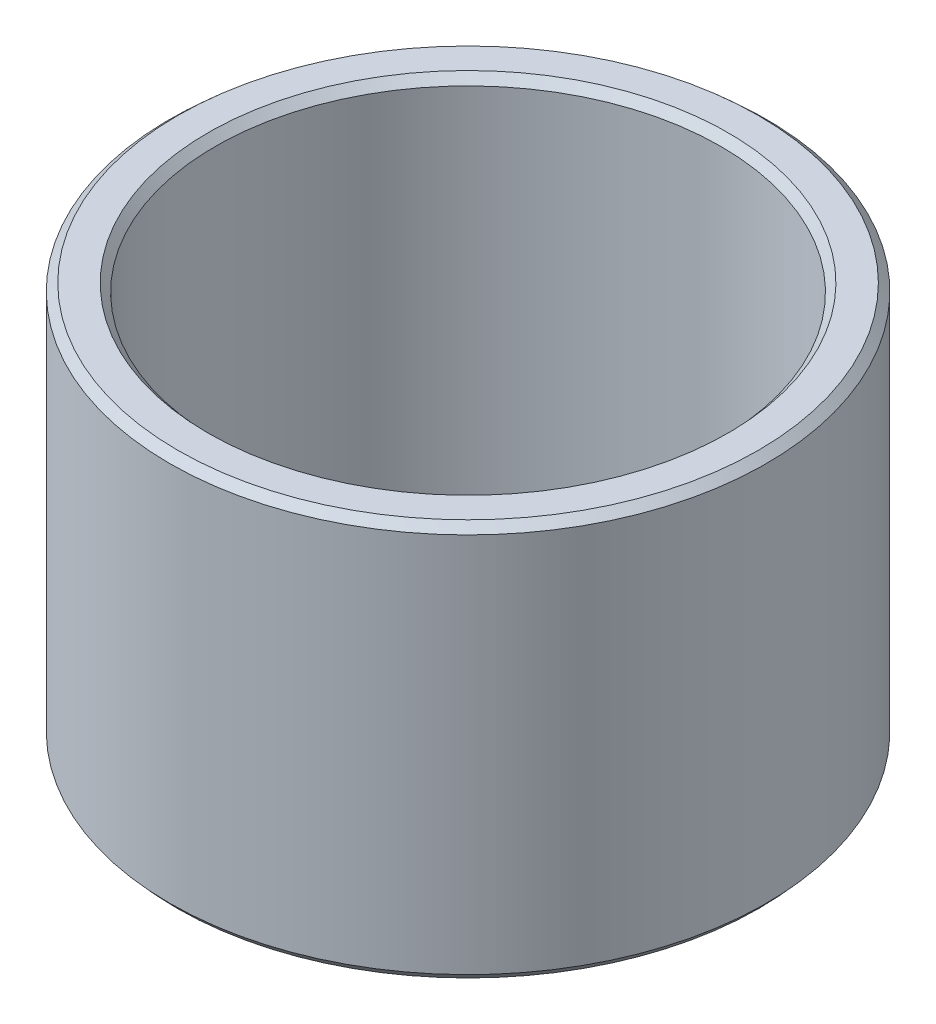
ISO-10303-21;
HEADER;
FILE_DESCRIPTION(('STEP AP214'),'2;1');
FILE_NAME('part.step','',(''),(''),'','','');
FILE_SCHEMA(('AUTOMOTIVE_DESIGN { 1 0 10303 214 1 1 1 1 }'));
ENDSEC;
DATA;
#1=APPLICATION_CONTEXT('core data for automotive mechanical design processes');
#2=APPLICATION_PROTOCOL_DEFINITION('international standard','automotive_design',2000,#1);
#3=PRODUCT_CONTEXT('',#1,'mechanical');
#4=PRODUCT('Part','Part','',(#3));
#5=PRODUCT_RELATED_PRODUCT_CATEGORY('part','',(#4));
#6=PRODUCT_DEFINITION_FORMATION('','',#4);
#7=PRODUCT_DEFINITION_CONTEXT('part definition',#1,'design');
#8=PRODUCT_DEFINITION('design','',#6,#7);
#9=PRODUCT_DEFINITION_SHAPE('','',#8);
#10=(LENGTH_UNIT() NAMED_UNIT(*) SI_UNIT(.MILLI.,.METRE.));
#11=(NAMED_UNIT(*) PLANE_ANGLE_UNIT() SI_UNIT($,.RADIAN.));
#12=(NAMED_UNIT(*) SI_UNIT($,.STERADIAN.) SOLID_ANGLE_UNIT());
#13=UNCERTAINTY_MEASURE_WITH_UNIT(LENGTH_MEASURE(1.E-05),#10,'distance_accuracy_value','');
#14=(GEOMETRIC_REPRESENTATION_CONTEXT(3) GLOBAL_UNCERTAINTY_ASSIGNED_CONTEXT((#13)) GLOBAL_UNIT_ASSIGNED_CONTEXT((#10,
#11,#12)) REPRESENTATION_CONTEXT('',''));
#15=CARTESIAN_POINT('',(0.,0.,0.));
#16=DIRECTION('',(0.,0.,1.));
#17=DIRECTION('',(1.,0.,0.));
#18=AXIS2_PLACEMENT_3D('',#15,#16,#17);
#19=CARTESIAN_POINT('',(0.,66.4309567733772,0.));
#20=DIRECTION('',(0.,-1.,0.));
#21=DIRECTION('',(0.,0.,-1.));
#22=AXIS2_PLACEMENT_3D('',#19,#20,#21);
#23=CYLINDRICAL_SURFACE('',#22,50.);
#24=CARTESIAN_POINT('',(0.,1.36173639824533,0.));
#25=DIRECTION('',(0.,1.,0.));
#26=DIRECTION('',(0.,0.,1.));
#27=AXIS2_PLACEMENT_3D('',#24,#25,#26);
#28=CIRCLE('',#27,50.);
#29=CARTESIAN_POINT('',(0.,1.36173639824533,50.));
#30=VERTEX_POINT('',#29);
#31=EDGE_CURVE('E10',#30,#30,#28,.T.);
#32=ORIENTED_EDGE('',*,*,#31,.T.);
#33=EDGE_LOOP('',(#32));
#34=FACE_BOUND('',#33,.T.);
#35=CARTESIAN_POINT('',(0.,65.1945600562519,0.));
#36=DIRECTION('',(0.,1.,0.));
#37=DIRECTION('',(0.,0.,1.));
#38=AXIS2_PLACEMENT_3D('',#35,#36,#37);
#39=CIRCLE('',#38,50.);
#40=CARTESIAN_POINT('',(0.,65.1945600562519,50.));
#41=VERTEX_POINT('',#40);
#42=EDGE_CURVE('E50',#41,#41,#39,.F.);
#43=ORIENTED_EDGE('',*,*,#42,.T.);
#44=EDGE_LOOP('',(#43));
#45=FACE_BOUND('',#44,.T.);
#46=ADVANCED_FACE('F39',(#34,#45),#23,.T.);
#47=CARTESIAN_POINT('',(0.,66.4309567733772,0.));
#48=DIRECTION('',(0.,1.,0.));
#49=DIRECTION('',(0.,0.,1.));
#50=AXIS2_PLACEMENT_3D('',#47,#48,#49);
#51=PLANE('',#50);
#52=CARTESIAN_POINT('',(0.,66.4309567733772,0.));
#53=DIRECTION('',(0.,1.,0.));
#54=DIRECTION('',(0.,0.,1.));
#55=AXIS2_PLACEMENT_3D('',#52,#53,#54);
#56=CIRCLE('',#55,43.6060893113572);
#57=CARTESIAN_POINT('',(0.,66.4309567733772,43.6060893113572));
#58=VERTEX_POINT('',#57);
#59=EDGE_CURVE('E58',#58,#58,#56,.F.);
#60=ORIENTED_EDGE('',*,*,#59,.T.);
#61=EDGE_LOOP('',(#60));
#62=FACE_BOUND('',#61,.T.);
#63=CARTESIAN_POINT('',(0.,66.4309567733772,0.));
#64=DIRECTION('',(0.,1.,0.));
#65=DIRECTION('',(0.,0.,1.));
#66=AXIS2_PLACEMENT_3D('',#63,#64,#65);
#67=CIRCLE('',#66,48.6382636017547);
#68=CARTESIAN_POINT('',(0.,66.4309567733772,48.6382636017547));
#69=VERTEX_POINT('',#68);
#70=EDGE_CURVE('E61',#69,#69,#67,.T.);
#71=ORIENTED_EDGE('',*,*,#70,.T.);
#72=EDGE_LOOP('',(#71));
#73=FACE_BOUND('',#72,.T.);
#74=ADVANCED_FACE('F88',(#62,#73),#51,.T.);
#75=CARTESIAN_POINT('',(0.,0.,0.));
#76=DIRECTION('',(0.,1.,0.));
#77=DIRECTION('',(0.,0.,1.));
#78=AXIS2_PLACEMENT_3D('',#75,#76,#77);
#79=PLANE('',#78);
#80=CARTESIAN_POINT('',(0.,0.,0.));
#81=DIRECTION('',(0.,1.,0.));
#82=DIRECTION('',(0.,0.,1.));
#83=AXIS2_PLACEMENT_3D('',#80,#81,#82);
#84=CIRCLE('',#83,43.7314289924773);
#85=CARTESIAN_POINT('',(0.,0.,43.7314289924773));
#86=VERTEX_POINT('',#85);
#87=EDGE_CURVE('E51',#86,#86,#84,.T.);
#88=ORIENTED_EDGE('',*,*,#87,.T.);
#89=EDGE_LOOP('',(#88));
#90=FACE_BOUND('',#89,.T.);
#91=CARTESIAN_POINT('',(0.,0.,0.));
#92=DIRECTION('',(0.,1.,0.));
#93=DIRECTION('',(0.,0.,1.));
#94=AXIS2_PLACEMENT_3D('',#91,#92,#93);
#95=CIRCLE('',#94,48.7636032828747);
#96=CARTESIAN_POINT('',(0.,0.,48.7636032828747));
#97=VERTEX_POINT('',#96);
#98=EDGE_CURVE('E54',#97,#97,#95,.F.);
#99=ORIENTED_EDGE('',*,*,#98,.T.);
#100=EDGE_LOOP('',(#99));
#101=FACE_BOUND('',#100,.T.);
#102=ADVANCED_FACE('F83',(#90,#101),#79,.F.);
#103=CARTESIAN_POINT('',(0.,66.4309567733772,0.));
#104=DIRECTION('',(0.,-1.,0.));
#105=DIRECTION('',(0.,0.,-1.));
#106=AXIS2_PLACEMENT_3D('',#103,#104,#105);
#107=CYLINDRICAL_SURFACE('',#106,42.3696925942319);
#108=CARTESIAN_POINT('',(0.,65.0692203751319,0.));
#109=DIRECTION('',(0.,1.,0.));
#110=DIRECTION('',(0.,0.,1.));
#111=AXIS2_PLACEMENT_3D('',#108,#109,#110);
#112=CIRCLE('',#111,42.3696925942319);
#113=CARTESIAN_POINT('',(0.,65.0692203751319,42.3696925942319));
#114=VERTEX_POINT('',#113);
#115=EDGE_CURVE('E67',#114,#114,#112,.T.);
#116=ORIENTED_EDGE('',*,*,#115,.T.);
#117=EDGE_LOOP('',(#116));
#118=FACE_BOUND('',#117,.T.);
#119=CARTESIAN_POINT('',(0.,1.2363967171253,0.));
#120=DIRECTION('',(0.,1.,0.));
#121=DIRECTION('',(0.,0.,1.));
#122=AXIS2_PLACEMENT_3D('',#119,#120,#121);
#123=CIRCLE('',#122,42.3696925942319);
#124=CARTESIAN_POINT('',(0.,1.2363967171253,42.3696925942319));
#125=VERTEX_POINT('',#124);
#126=EDGE_CURVE('E69',#125,#125,#123,.F.);
#127=ORIENTED_EDGE('',*,*,#126,.T.);
#128=EDGE_LOOP('',(#127));
#129=FACE_BOUND('',#128,.T.);
#130=ADVANCED_FACE('F71',(#118,#129),#107,.F.);
#131=CARTESIAN_POINT('',(0.,65.0692203751319,0.));
#132=DIRECTION('',(0.,1.,0.));
#133=DIRECTION('',(0.,0.,1.));
#134=AXIS2_PLACEMENT_3D('',#131,#132,#133);
#135=CONICAL_SURFACE('',#134,42.3696925942319,0.737193326957112);
#136=ORIENTED_EDGE('',*,*,#59,.F.);
#137=EDGE_LOOP('',(#136));
#138=FACE_BOUND('',#137,.T.);
#139=ORIENTED_EDGE('',*,*,#115,.F.);
#140=EDGE_LOOP('',(#139));
#141=FACE_BOUND('',#140,.T.);
#142=ADVANCED_FACE('F77',(#138,#141),#135,.F.);
#143=CARTESIAN_POINT('',(0.,0.,0.));
#144=DIRECTION('',(0.,-1.,0.));
#145=DIRECTION('',(0.,0.,-1.));
#146=AXIS2_PLACEMENT_3D('',#143,#144,#145);
#147=CONICAL_SURFACE('',#146,43.7314289924773,0.833602999837768);
#148=ORIENTED_EDGE('',*,*,#126,.F.);
#149=EDGE_LOOP('',(#148));
#150=FACE_BOUND('',#149,.T.);
#151=ORIENTED_EDGE('',*,*,#87,.F.);
#152=EDGE_LOOP('',(#151));
#153=FACE_BOUND('',#152,.T.);
#154=ADVANCED_FACE('F73',(#150,#153),#147,.F.);
#155=CARTESIAN_POINT('',(0.,1.36173639824533,0.));
#156=DIRECTION('',(0.,1.,0.));
#157=DIRECTION('',(0.,0.,1.));
#158=AXIS2_PLACEMENT_3D('',#155,#156,#157);
#159=CONICAL_SURFACE('',#158,50.,0.737193326957118);
#160=ORIENTED_EDGE('',*,*,#98,.F.);
#161=EDGE_LOOP('',(#160));
#162=FACE_BOUND('',#161,.T.);
#163=ORIENTED_EDGE('',*,*,#31,.F.);
#164=EDGE_LOOP('',(#163));
#165=FACE_BOUND('',#164,.T.);
#166=ADVANCED_FACE('F76',(#162,#165),#159,.T.);
#167=CARTESIAN_POINT('',(0.,66.4309567733772,0.));
#168=DIRECTION('',(0.,-1.,0.));
#169=DIRECTION('',(0.,0.,-1.));
#170=AXIS2_PLACEMENT_3D('',#167,#168,#169);
#171=CONICAL_SURFACE('',#170,48.6382636017547,0.83360299983776);
#172=ORIENTED_EDGE('',*,*,#42,.F.);
#173=EDGE_LOOP('',(#172));
#174=FACE_BOUND('',#173,.T.);
#175=ORIENTED_EDGE('',*,*,#70,.F.);
#176=EDGE_LOOP('',(#175));
#177=FACE_BOUND('',#176,.T.);
#178=ADVANCED_FACE('F45',(#174,#177),#171,.T.);
#179=CLOSED_SHELL('',(#46,#74,#102,#130,#142,#154,#166,#178));
#180=MANIFOLD_SOLID_BREP('B2',#179);
#181=ADVANCED_BREP_SHAPE_REPRESENTATION('',(#18,#180),#14);
#182=SHAPE_DEFINITION_REPRESENTATION(#9,#181);
ENDSEC;
END-ISO-10303-21;
